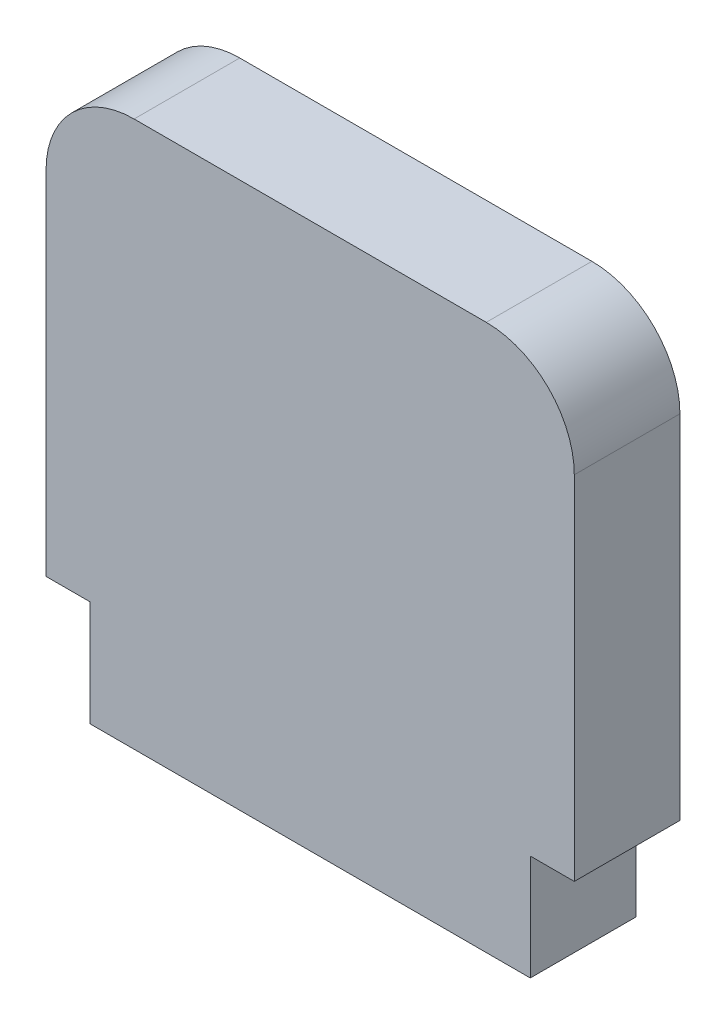
ISO-10303-21;
HEADER;
FILE_DESCRIPTION(('STEP AP214'),'2;1');
FILE_NAME('part.step','',(''),(''),'','','');
FILE_SCHEMA(('AUTOMOTIVE_DESIGN { 1 0 10303 214 1 1 1 1 }'));
ENDSEC;
DATA;
#1=APPLICATION_CONTEXT('core data for automotive mechanical design processes');
#2=APPLICATION_PROTOCOL_DEFINITION('international standard','automotive_design',2000,#1);
#3=PRODUCT_CONTEXT('',#1,'mechanical');
#4=PRODUCT('Part','Part','',(#3));
#5=PRODUCT_RELATED_PRODUCT_CATEGORY('part','',(#4));
#6=PRODUCT_DEFINITION_FORMATION('','',#4);
#7=PRODUCT_DEFINITION_CONTEXT('part definition',#1,'design');
#8=PRODUCT_DEFINITION('design','',#6,#7);
#9=PRODUCT_DEFINITION_SHAPE('','',#8);
#10=(LENGTH_UNIT() NAMED_UNIT(*) SI_UNIT(.MILLI.,.METRE.));
#11=(NAMED_UNIT(*) PLANE_ANGLE_UNIT() SI_UNIT($,.RADIAN.));
#12=(NAMED_UNIT(*) SI_UNIT($,.STERADIAN.) SOLID_ANGLE_UNIT());
#13=UNCERTAINTY_MEASURE_WITH_UNIT(LENGTH_MEASURE(1.E-05),#10,'distance_accuracy_value','');
#14=(GEOMETRIC_REPRESENTATION_CONTEXT(3) GLOBAL_UNCERTAINTY_ASSIGNED_CONTEXT((#13)) GLOBAL_UNIT_ASSIGNED_CONTEXT((#10,
#11,#12)) REPRESENTATION_CONTEXT('',''));
#15=CARTESIAN_POINT('',(0.,0.,0.));
#16=DIRECTION('',(0.,0.,1.));
#17=DIRECTION('',(1.,0.,0.));
#18=AXIS2_PLACEMENT_3D('',#15,#16,#17);
#19=CARTESIAN_POINT('',(0.,-12.5,6.));
#20=DIRECTION('',(0.,1.,0.));
#21=DIRECTION('',(-1.,0.,0.));
#22=AXIS2_PLACEMENT_3D('',#19,#20,#21);
#23=PLANE('',#22);
#24=DIRECTION('',(1.,0.,0.));
#25=VECTOR('',#24,1.);
#26=CARTESIAN_POINT('',(0.,-12.5,0.));
#27=LINE('',#26,#25);
#28=CARTESIAN_POINT('',(-15.,-12.5,0.));
#29=VERTEX_POINT('',#28);
#30=CARTESIAN_POINT('',(-12.5,-12.5,0.));
#31=VERTEX_POINT('',#30);
#32=EDGE_CURVE('E129',#29,#31,#27,.T.);
#33=ORIENTED_EDGE('',*,*,#32,.T.);
#34=DIRECTION('',(0.,0.,-1.));
#35=VECTOR('',#34,1.);
#36=CARTESIAN_POINT('',(-12.5,-12.5,6.));
#37=LINE('',#36,#35);
#38=CARTESIAN_POINT('',(-12.5,-12.5,6.));
#39=VERTEX_POINT('',#38);
#40=EDGE_CURVE('E127',#39,#31,#37,.T.);
#41=ORIENTED_EDGE('',*,*,#40,.F.);
#42=DIRECTION('',(1.,0.,0.));
#43=VECTOR('',#42,1.);
#44=CARTESIAN_POINT('',(0.,-12.5,6.));
#45=LINE('',#44,#43);
#46=CARTESIAN_POINT('',(-15.,-12.5,6.));
#47=VERTEX_POINT('',#46);
#48=EDGE_CURVE('E114',#47,#39,#45,.T.);
#49=ORIENTED_EDGE('',*,*,#48,.F.);
#50=DIRECTION('',(0.,0.,-1.));
#51=VECTOR('',#50,1.);
#52=CARTESIAN_POINT('',(-15.,-12.5,6.));
#53=LINE('',#52,#51);
#54=EDGE_CURVE('E149',#47,#29,#53,.T.);
#55=ORIENTED_EDGE('',*,*,#54,.T.);
#56=EDGE_LOOP('',(#33,#41,#49,#55));
#57=FACE_BOUND('',#56,.T.);
#58=ADVANCED_FACE('F34',(#57),#23,.F.);
#59=CARTESIAN_POINT('',(-12.5,0.,6.));
#60=DIRECTION('',(-1.,0.,0.));
#61=DIRECTION('',(0.,-1.,0.));
#62=AXIS2_PLACEMENT_3D('',#59,#60,#61);
#63=PLANE('',#62);
#64=DIRECTION('',(0.,1.,0.));
#65=VECTOR('',#64,1.);
#66=CARTESIAN_POINT('',(-12.5,0.,0.));
#67=LINE('',#66,#65);
#68=CARTESIAN_POINT('',(-12.5,-18.5,0.));
#69=VERTEX_POINT('',#68);
#70=EDGE_CURVE('E151',#69,#31,#67,.T.);
#71=ORIENTED_EDGE('',*,*,#70,.F.);
#72=DIRECTION('',(0.,0.,-1.));
#73=VECTOR('',#72,1.);
#74=CARTESIAN_POINT('',(-12.5,-18.5,6.));
#75=LINE('',#74,#73);
#76=CARTESIAN_POINT('',(-12.5,-18.5,6.));
#77=VERTEX_POINT('',#76);
#78=EDGE_CURVE('E134',#77,#69,#75,.T.);
#79=ORIENTED_EDGE('',*,*,#78,.F.);
#80=DIRECTION('',(0.,1.,0.));
#81=VECTOR('',#80,1.);
#82=CARTESIAN_POINT('',(-12.5,0.,6.));
#83=LINE('',#82,#81);
#84=EDGE_CURVE('E119',#77,#39,#83,.T.);
#85=ORIENTED_EDGE('',*,*,#84,.T.);
#86=ORIENTED_EDGE('',*,*,#40,.T.);
#87=EDGE_LOOP('',(#71,#79,#85,#86));
#88=FACE_BOUND('',#87,.T.);
#89=ADVANCED_FACE('F136',(#88),#63,.T.);
#90=CARTESIAN_POINT('',(0.,-18.5,6.));
#91=DIRECTION('',(0.,-1.,0.));
#92=DIRECTION('',(0.,0.,-1.));
#93=AXIS2_PLACEMENT_3D('',#90,#91,#92);
#94=PLANE('',#93);
#95=DIRECTION('',(-1.,0.,0.));
#96=VECTOR('',#95,1.);
#97=CARTESIAN_POINT('',(0.,-18.5,0.));
#98=LINE('',#97,#96);
#99=CARTESIAN_POINT('',(12.5,-18.5,0.));
#100=VERTEX_POINT('',#99);
#101=EDGE_CURVE('E154',#100,#69,#98,.T.);
#102=ORIENTED_EDGE('',*,*,#101,.F.);
#103=DIRECTION('',(0.,0.,-1.));
#104=VECTOR('',#103,1.);
#105=CARTESIAN_POINT('',(12.5,-18.5,6.));
#106=LINE('',#105,#104);
#107=CARTESIAN_POINT('',(12.5,-18.5,6.));
#108=VERTEX_POINT('',#107);
#109=EDGE_CURVE('E173',#108,#100,#106,.T.);
#110=ORIENTED_EDGE('',*,*,#109,.F.);
#111=DIRECTION('',(-1.,0.,0.));
#112=VECTOR('',#111,1.);
#113=CARTESIAN_POINT('',(0.,-18.5,6.));
#114=LINE('',#113,#112);
#115=EDGE_CURVE('E137',#108,#77,#114,.T.);
#116=ORIENTED_EDGE('',*,*,#115,.T.);
#117=ORIENTED_EDGE('',*,*,#78,.T.);
#118=EDGE_LOOP('',(#102,#110,#116,#117));
#119=FACE_BOUND('',#118,.T.);
#120=ADVANCED_FACE('F207',(#119),#94,.T.);
#121=CARTESIAN_POINT('',(12.5,0.,6.));
#122=DIRECTION('',(-1.,0.,0.));
#123=DIRECTION('',(0.,-1.,0.));
#124=AXIS2_PLACEMENT_3D('',#121,#122,#123);
#125=PLANE('',#124);
#126=DIRECTION('',(0.,1.,0.));
#127=VECTOR('',#126,1.);
#128=CARTESIAN_POINT('',(12.5,0.,0.));
#129=LINE('',#128,#127);
#130=CARTESIAN_POINT('',(12.5,-12.5,0.));
#131=VERTEX_POINT('',#130);
#132=EDGE_CURVE('E157',#100,#131,#129,.T.);
#133=ORIENTED_EDGE('',*,*,#132,.T.);
#134=DIRECTION('',(0.,0.,-1.));
#135=VECTOR('',#134,1.);
#136=CARTESIAN_POINT('',(12.5,-12.5,6.));
#137=LINE('',#136,#135);
#138=CARTESIAN_POINT('',(12.5,-12.5,6.));
#139=VERTEX_POINT('',#138);
#140=EDGE_CURVE('E170',#139,#131,#137,.T.);
#141=ORIENTED_EDGE('',*,*,#140,.F.);
#142=DIRECTION('',(0.,1.,0.));
#143=VECTOR('',#142,1.);
#144=CARTESIAN_POINT('',(12.5,0.,6.));
#145=LINE('',#144,#143);
#146=EDGE_CURVE('E139',#108,#139,#145,.T.);
#147=ORIENTED_EDGE('',*,*,#146,.F.);
#148=ORIENTED_EDGE('',*,*,#109,.T.);
#149=EDGE_LOOP('',(#133,#141,#147,#148));
#150=FACE_BOUND('',#149,.T.);
#151=ADVANCED_FACE('F227',(#150),#125,.F.);
#152=CARTESIAN_POINT('',(15.,-12.5,0.));
#153=VERTEX_POINT('',#152);
#154=EDGE_CURVE('E152',#131,#153,#27,.T.);
#155=ORIENTED_EDGE('',*,*,#154,.T.);
#156=DIRECTION('',(0.,0.,-1.));
#157=VECTOR('',#156,1.);
#158=CARTESIAN_POINT('',(15.,-12.5,6.));
#159=LINE('',#158,#157);
#160=CARTESIAN_POINT('',(15.,-12.5,6.));
#161=VERTEX_POINT('',#160);
#162=EDGE_CURVE('E167',#161,#153,#159,.T.);
#163=ORIENTED_EDGE('',*,*,#162,.F.);
#164=EDGE_CURVE('E125',#139,#161,#45,.T.);
#165=ORIENTED_EDGE('',*,*,#164,.F.);
#166=ORIENTED_EDGE('',*,*,#140,.T.);
#167=EDGE_LOOP('',(#155,#163,#165,#166));
#168=FACE_BOUND('',#167,.T.);
#169=ADVANCED_FACE('F201',(#168),#23,.F.);
#170=CARTESIAN_POINT('',(15.,0.,6.));
#171=DIRECTION('',(-1.,0.,0.));
#172=DIRECTION('',(0.,0.,1.));
#173=AXIS2_PLACEMENT_3D('',#170,#171,#172);
#174=PLANE('',#173);
#175=DIRECTION('',(0.,1.,0.));
#176=VECTOR('',#175,1.);
#177=CARTESIAN_POINT('',(15.,0.,0.));
#178=LINE('',#177,#176);
#179=CARTESIAN_POINT('',(15.,7.5,0.));
#180=VERTEX_POINT('',#179);
#181=EDGE_CURVE('E159',#153,#180,#178,.T.);
#182=ORIENTED_EDGE('',*,*,#181,.T.);
#183=DIRECTION('',(0.,0.,-1.));
#184=VECTOR('',#183,1.);
#185=CARTESIAN_POINT('',(15.,7.5,6.));
#186=LINE('',#185,#184);
#187=CARTESIAN_POINT('',(15.,7.5,6.));
#188=VERTEX_POINT('',#187);
#189=EDGE_CURVE('E57',#180,#188,#186,.F.);
#190=ORIENTED_EDGE('',*,*,#189,.T.);
#191=DIRECTION('',(0.,1.,0.));
#192=VECTOR('',#191,1.);
#193=CARTESIAN_POINT('',(15.,0.,6.));
#194=LINE('',#193,#192);
#195=EDGE_CURVE('E143',#161,#188,#194,.T.);
#196=ORIENTED_EDGE('',*,*,#195,.F.);
#197=ORIENTED_EDGE('',*,*,#162,.T.);
#198=EDGE_LOOP('',(#182,#190,#196,#197));
#199=FACE_BOUND('',#198,.T.);
#200=ADVANCED_FACE('F197',(#199),#174,.F.);
#201=CARTESIAN_POINT('',(0.,12.5,6.));
#202=DIRECTION('',(0.,1.,0.));
#203=DIRECTION('',(-1.,0.,0.));
#204=AXIS2_PLACEMENT_3D('',#201,#202,#203);
#205=PLANE('',#204);
#206=DIRECTION('',(1.,0.,0.));
#207=VECTOR('',#206,1.);
#208=CARTESIAN_POINT('',(0.,12.5,6.));
#209=LINE('',#208,#207);
#210=CARTESIAN_POINT('',(-9.99999999999999,12.5,6.));
#211=VERTEX_POINT('',#210);
#212=CARTESIAN_POINT('',(10.,12.5,6.));
#213=VERTEX_POINT('',#212);
#214=EDGE_CURVE('E145',#211,#213,#209,.T.);
#215=ORIENTED_EDGE('',*,*,#214,.T.);
#216=DIRECTION('',(0.,0.,-1.));
#217=VECTOR('',#216,1.);
#218=CARTESIAN_POINT('',(10.,12.5,0.));
#219=LINE('',#218,#217);
#220=CARTESIAN_POINT('',(10.,12.5,0.));
#221=VERTEX_POINT('',#220);
#222=EDGE_CURVE('E177',#213,#221,#219,.T.);
#223=ORIENTED_EDGE('',*,*,#222,.T.);
#224=DIRECTION('',(1.,0.,0.));
#225=VECTOR('',#224,1.);
#226=CARTESIAN_POINT('',(0.,12.5,0.));
#227=LINE('',#226,#225);
#228=CARTESIAN_POINT('',(-9.99999999999999,12.5,0.));
#229=VERTEX_POINT('',#228);
#230=EDGE_CURVE('E161',#229,#221,#227,.T.);
#231=ORIENTED_EDGE('',*,*,#230,.F.);
#232=DIRECTION('',(0.,0.,-1.));
#233=VECTOR('',#232,1.);
#234=CARTESIAN_POINT('',(-9.99999999999999,12.5,6.));
#235=LINE('',#234,#233);
#236=EDGE_CURVE('E133',#229,#211,#235,.F.);
#237=ORIENTED_EDGE('',*,*,#236,.T.);
#238=EDGE_LOOP('',(#215,#223,#231,#237));
#239=FACE_BOUND('',#238,.T.);
#240=ADVANCED_FACE('F189',(#239),#205,.T.);
#241=CARTESIAN_POINT('',(-15.,0.,6.));
#242=DIRECTION('',(-1.,0.,0.));
#243=DIRECTION('',(0.,0.,1.));
#244=AXIS2_PLACEMENT_3D('',#241,#242,#243);
#245=PLANE('',#244);
#246=DIRECTION('',(0.,1.,0.));
#247=VECTOR('',#246,1.);
#248=CARTESIAN_POINT('',(-15.,0.,6.));
#249=LINE('',#248,#247);
#250=CARTESIAN_POINT('',(-15.,7.5,6.));
#251=VERTEX_POINT('',#250);
#252=EDGE_CURVE('E121',#47,#251,#249,.T.);
#253=ORIENTED_EDGE('',*,*,#252,.T.);
#254=DIRECTION('',(0.,0.,-1.));
#255=VECTOR('',#254,1.);
#256=CARTESIAN_POINT('',(-15.,7.5,6.));
#257=LINE('',#256,#255);
#258=CARTESIAN_POINT('',(-15.,7.5,0.));
#259=VERTEX_POINT('',#258);
#260=EDGE_CURVE('E11',#251,#259,#257,.T.);
#261=ORIENTED_EDGE('',*,*,#260,.T.);
#262=DIRECTION('',(0.,1.,0.));
#263=VECTOR('',#262,1.);
#264=CARTESIAN_POINT('',(-15.,0.,0.));
#265=LINE('',#264,#263);
#266=EDGE_CURVE('E123',#29,#259,#265,.T.);
#267=ORIENTED_EDGE('',*,*,#266,.F.);
#268=ORIENTED_EDGE('',*,*,#54,.F.);
#269=EDGE_LOOP('',(#253,#261,#267,#268));
#270=FACE_BOUND('',#269,.T.);
#271=ADVANCED_FACE('F211',(#270),#245,.T.);
#272=CARTESIAN_POINT('',(0.,0.,6.));
#273=DIRECTION('',(0.,0.,1.));
#274=DIRECTION('',(1.,0.,0.));
#275=AXIS2_PLACEMENT_3D('',#272,#273,#274);
#276=PLANE('',#275);
#277=ORIENTED_EDGE('',*,*,#195,.T.);
#278=CARTESIAN_POINT('',(10.,7.5,6.));
#279=DIRECTION('',(0.,0.,1.));
#280=DIRECTION('',(1.,0.,0.));
#281=AXIS2_PLACEMENT_3D('',#278,#279,#280);
#282=CIRCLE('',#281,5.);
#283=EDGE_CURVE('E42',#188,#213,#282,.T.);
#284=ORIENTED_EDGE('',*,*,#283,.T.);
#285=ORIENTED_EDGE('',*,*,#214,.F.);
#286=CARTESIAN_POINT('',(-9.99999999999999,7.5,6.));
#287=DIRECTION('',(0.,0.,1.));
#288=DIRECTION('',(1.,0.,0.));
#289=AXIS2_PLACEMENT_3D('',#286,#287,#288);
#290=CIRCLE('',#289,5.);
#291=EDGE_CURVE('E49',#211,#251,#290,.T.);
#292=ORIENTED_EDGE('',*,*,#291,.T.);
#293=ORIENTED_EDGE('',*,*,#252,.F.);
#294=ORIENTED_EDGE('',*,*,#48,.T.);
#295=ORIENTED_EDGE('',*,*,#84,.F.);
#296=ORIENTED_EDGE('',*,*,#115,.F.);
#297=ORIENTED_EDGE('',*,*,#146,.T.);
#298=ORIENTED_EDGE('',*,*,#164,.T.);
#299=EDGE_LOOP('',(#277,#284,#285,#292,#293,#294,#295,#296,#297,#298));
#300=FACE_BOUND('',#299,.T.);
#301=ADVANCED_FACE('F116',(#300),#276,.T.);
#302=CARTESIAN_POINT('',(0.,0.,0.));
#303=DIRECTION('',(0.,0.,1.));
#304=DIRECTION('',(1.,0.,0.));
#305=AXIS2_PLACEMENT_3D('',#302,#303,#304);
#306=PLANE('',#305);
#307=ORIENTED_EDGE('',*,*,#230,.T.);
#308=CARTESIAN_POINT('',(10.,7.5,0.));
#309=DIRECTION('',(0.,0.,1.));
#310=DIRECTION('',(1.,0.,0.));
#311=AXIS2_PLACEMENT_3D('',#308,#309,#310);
#312=CIRCLE('',#311,5.);
#313=EDGE_CURVE('E182',#221,#180,#312,.F.);
#314=ORIENTED_EDGE('',*,*,#313,.T.);
#315=ORIENTED_EDGE('',*,*,#181,.F.);
#316=ORIENTED_EDGE('',*,*,#154,.F.);
#317=ORIENTED_EDGE('',*,*,#132,.F.);
#318=ORIENTED_EDGE('',*,*,#101,.T.);
#319=ORIENTED_EDGE('',*,*,#70,.T.);
#320=ORIENTED_EDGE('',*,*,#32,.F.);
#321=ORIENTED_EDGE('',*,*,#266,.T.);
#322=CARTESIAN_POINT('',(-9.99999999999999,7.5,0.));
#323=DIRECTION('',(0.,0.,1.));
#324=DIRECTION('',(1.,0.,0.));
#325=AXIS2_PLACEMENT_3D('',#322,#323,#324);
#326=CIRCLE('',#325,5.);
#327=EDGE_CURVE('E180',#259,#229,#326,.F.);
#328=ORIENTED_EDGE('',*,*,#327,.T.);
#329=EDGE_LOOP('',(#307,#314,#315,#316,#317,#318,#319,#320,#321,#328));
#330=FACE_BOUND('',#329,.T.);
#331=ADVANCED_FACE('F195',(#330),#306,.F.);
#332=CARTESIAN_POINT('',(10.,7.5,6.));
#333=DIRECTION('',(0.,0.,1.));
#334=DIRECTION('',(1.,0.,0.));
#335=AXIS2_PLACEMENT_3D('',#332,#333,#334);
#336=CYLINDRICAL_SURFACE('',#335,5.);
#337=ORIENTED_EDGE('',*,*,#283,.F.);
#338=ORIENTED_EDGE('',*,*,#189,.F.);
#339=ORIENTED_EDGE('',*,*,#313,.F.);
#340=ORIENTED_EDGE('',*,*,#222,.F.);
#341=EDGE_LOOP('',(#337,#338,#339,#340));
#342=FACE_BOUND('',#341,.T.);
#343=ADVANCED_FACE('F192',(#342),#336,.T.);
#344=CARTESIAN_POINT('',(-9.99999999999999,7.5,6.));
#345=DIRECTION('',(0.,0.,-1.));
#346=DIRECTION('',(-1.,0.,0.));
#347=AXIS2_PLACEMENT_3D('',#344,#345,#346);
#348=CYLINDRICAL_SURFACE('',#347,5.);
#349=ORIENTED_EDGE('',*,*,#291,.F.);
#350=ORIENTED_EDGE('',*,*,#236,.F.);
#351=ORIENTED_EDGE('',*,*,#327,.F.);
#352=ORIENTED_EDGE('',*,*,#260,.F.);
#353=EDGE_LOOP('',(#349,#350,#351,#352));
#354=FACE_BOUND('',#353,.T.);
#355=ADVANCED_FACE('F36',(#354),#348,.T.);
#356=CLOSED_SHELL('',(#58,#89,#120,#151,#169,#200,#240,#271,#301,#331,#343,#355));
#357=MANIFOLD_SOLID_BREP('B2',#356);
#358=ADVANCED_BREP_SHAPE_REPRESENTATION('',(#18,#357),#14);
#359=SHAPE_DEFINITION_REPRESENTATION(#9,#358);
ENDSEC;
END-ISO-10303-21;
